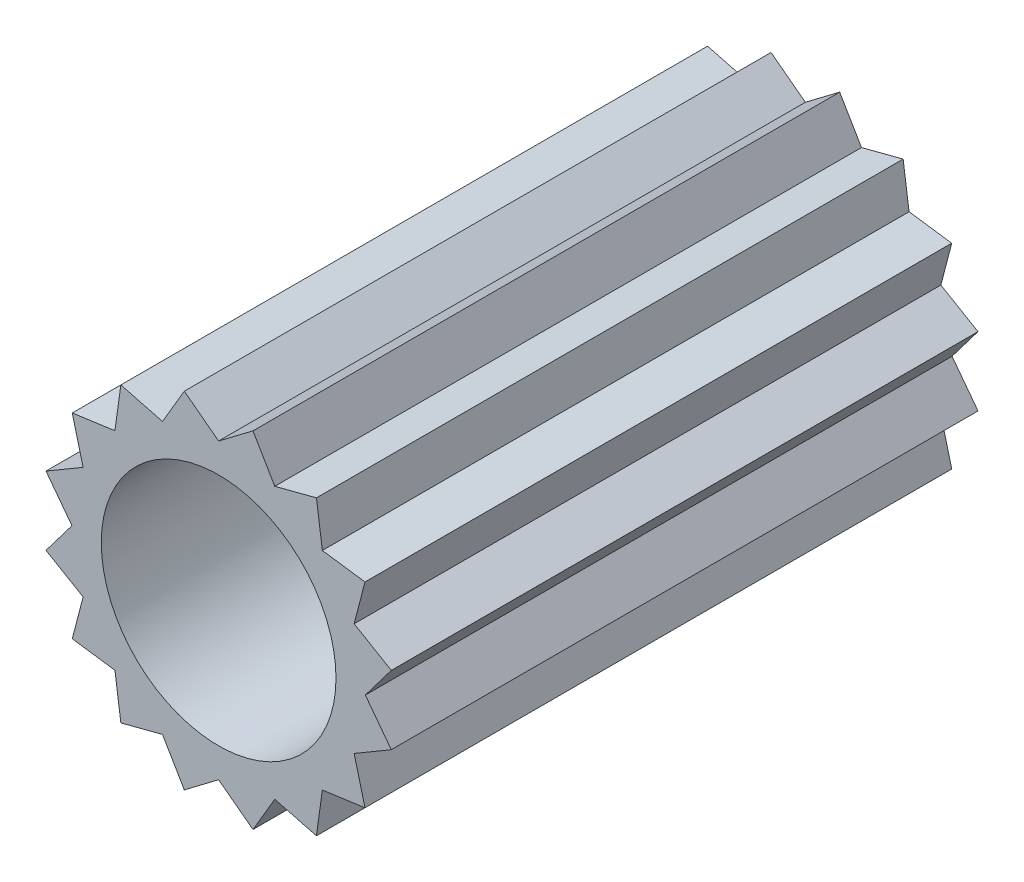
ISO-10303-21;
HEADER;
FILE_DESCRIPTION(('STEP AP214'),'2;1');
FILE_NAME('part.step','',(''),(''),'','','');
FILE_SCHEMA(('AUTOMOTIVE_DESIGN { 1 0 10303 214 1 1 1 1 }'));
ENDSEC;
DATA;
#1=APPLICATION_CONTEXT('core data for automotive mechanical design processes');
#2=APPLICATION_PROTOCOL_DEFINITION('international standard','automotive_design',2000,#1);
#3=PRODUCT_CONTEXT('',#1,'mechanical');
#4=PRODUCT('Part','Part','',(#3));
#5=PRODUCT_RELATED_PRODUCT_CATEGORY('part','',(#4));
#6=PRODUCT_DEFINITION_FORMATION('','',#4);
#7=PRODUCT_DEFINITION_CONTEXT('part definition',#1,'design');
#8=PRODUCT_DEFINITION('design','',#6,#7);
#9=PRODUCT_DEFINITION_SHAPE('','',#8);
#10=(LENGTH_UNIT() NAMED_UNIT(*) SI_UNIT(.MILLI.,.METRE.));
#11=(NAMED_UNIT(*) PLANE_ANGLE_UNIT() SI_UNIT($,.RADIAN.));
#12=(NAMED_UNIT(*) SI_UNIT($,.STERADIAN.) SOLID_ANGLE_UNIT());
#13=UNCERTAINTY_MEASURE_WITH_UNIT(LENGTH_MEASURE(1.E-05),#10,'distance_accuracy_value','');
#14=(GEOMETRIC_REPRESENTATION_CONTEXT(3) GLOBAL_UNCERTAINTY_ASSIGNED_CONTEXT((#13)) GLOBAL_UNIT_ASSIGNED_CONTEXT((#10,
#11,#12)) REPRESENTATION_CONTEXT('',''));
#15=CARTESIAN_POINT('',(0.,0.,0.));
#16=DIRECTION('',(0.,0.,1.));
#17=DIRECTION('',(1.,0.,0.));
#18=AXIS2_PLACEMENT_3D('',#15,#16,#17);
#19=CARTESIAN_POINT('',(0.,0.,10.));
#20=DIRECTION('',(0.,0.,-1.));
#21=DIRECTION('',(-1.,0.,0.));
#22=AXIS2_PLACEMENT_3D('',#19,#20,#21);
#23=PLANE('',#22);
#24=DIRECTION('',(-0.797768242617917,0.602964203805102,0.));
#25=VECTOR('',#24,1.);
#26=CARTESIAN_POINT('',(-0.58527096604841,2.94235584120969,10.));
#27=LINE('',#26,#25);
#28=CARTESIAN_POINT('',(0.,2.5,10.));
#29=VERTEX_POINT('',#28);
#30=CARTESIAN_POINT('',(-0.58527096604841,2.94235584120969,10.));
#31=VERTEX_POINT('',#30);
#32=EDGE_CURVE('E380',#29,#31,#27,.T.);
#33=ORIENTED_EDGE('',*,*,#32,.T.);
#34=DIRECTION('',(-0.506297339936732,-0.862358976049411,0.));
#35=VECTOR('',#34,1.);
#36=CARTESIAN_POINT('',(-0.956708580912729,2.30969883127822,10.));
#37=LINE('',#36,#35);
#38=CARTESIAN_POINT('',(-0.956708580912729,2.30969883127822,10.));
#39=VERTEX_POINT('',#38);
#40=EDGE_CURVE('E172',#31,#39,#37,.T.);
#41=ORIENTED_EDGE('',*,*,#40,.T.);
#42=DIRECTION('',(-0.967786162147611,0.25177359741561,0.));
#43=VECTOR('',#42,1.);
#44=CARTESIAN_POINT('',(-1.66671069905883,2.49440883690762,10.));
#45=LINE('',#44,#43);
#46=CARTESIAN_POINT('',(-1.66671069905883,2.49440883690762,10.));
#47=VERTEX_POINT('',#46);
#48=EDGE_CURVE('E497',#39,#47,#45,.T.);
#49=ORIENTED_EDGE('',*,*,#48,.T.);
#50=DIRECTION('',(-0.137747256847024,-0.990467411493745,0.));
#51=VECTOR('',#50,1.);
#52=CARTESIAN_POINT('',(-1.76776695296638,1.76776695296637,10.));
#53=LINE('',#52,#51);
#54=CARTESIAN_POINT('',(-1.76776695296638,1.76776695296637,10.));
#55=VERTEX_POINT('',#54);
#56=EDGE_CURVE('E517',#47,#55,#53,.T.);
#57=ORIENTED_EDGE('',*,*,#56,.T.);
#58=DIRECTION('',(-0.990467411493739,-0.137747256847065,0.));
#59=VECTOR('',#58,1.);
#60=CARTESIAN_POINT('',(-2.49440883690765,1.66671069905879,10.));
#61=LINE('',#60,#59);
#62=CARTESIAN_POINT('',(-2.49440883690765,1.66671069905879,10.));
#63=VERTEX_POINT('',#62);
#64=EDGE_CURVE('E513',#55,#63,#61,.T.);
#65=ORIENTED_EDGE('',*,*,#64,.T.);
#66=DIRECTION('',(0.25177359741565,-0.967786162147601,0.));
#67=VECTOR('',#66,1.);
#68=CARTESIAN_POINT('',(-2.30969883127823,0.956708580912722,10.));
#69=LINE('',#68,#67);
#70=CARTESIAN_POINT('',(-2.30969883127823,0.956708580912722,10.));
#71=VERTEX_POINT('',#70);
#72=EDGE_CURVE('E516',#63,#71,#69,.T.);
#73=ORIENTED_EDGE('',*,*,#72,.T.);
#74=DIRECTION('',(-0.862358976049388,-0.506297339936772,0.));
#75=VECTOR('',#74,1.);
#76=CARTESIAN_POINT('',(-2.9423558412097,0.585270966048359,10.));
#77=LINE('',#76,#75);
#78=CARTESIAN_POINT('',(-2.9423558412097,0.585270966048359,10.));
#79=VERTEX_POINT('',#78);
#80=EDGE_CURVE('E521',#71,#79,#77,.T.);
#81=ORIENTED_EDGE('',*,*,#80,.T.);
#82=DIRECTION('',(0.602964203805136,-0.797768242617891,0.));
#83=VECTOR('',#82,1.);
#84=CARTESIAN_POINT('',(-2.50000000000001,0.,10.));
#85=LINE('',#84,#83);
#86=CARTESIAN_POINT('',(-2.50000000000001,0.,10.));
#87=VERTEX_POINT('',#86);
#88=EDGE_CURVE('E528',#79,#87,#85,.T.);
#89=ORIENTED_EDGE('',*,*,#88,.T.);
#90=DIRECTION('',(-0.602964203805102,-0.797768242617917,0.));
#91=VECTOR('',#90,1.);
#92=CARTESIAN_POINT('',(-2.94235584120969,-0.585270966048414,10.));
#93=LINE('',#92,#91);
#94=CARTESIAN_POINT('',(-2.94235584120969,-0.585270966048414,10.));
#95=VERTEX_POINT('',#94);
#96=EDGE_CURVE('E531',#87,#95,#93,.T.);
#97=ORIENTED_EDGE('',*,*,#96,.T.);
#98=DIRECTION('',(0.86235897604941,-0.506297339936735,0.));
#99=VECTOR('',#98,1.);
#100=CARTESIAN_POINT('',(-2.30969883127823,-0.956708580912735,10.));
#101=LINE('',#100,#99);
#102=CARTESIAN_POINT('',(-2.30969883127823,-0.956708580912735,10.));
#103=VERTEX_POINT('',#102);
#104=EDGE_CURVE('E534',#95,#103,#101,.T.);
#105=ORIENTED_EDGE('',*,*,#104,.T.);
#106=DIRECTION('',(-0.251773597415609,-0.967786162147611,0.));
#107=VECTOR('',#106,1.);
#108=CARTESIAN_POINT('',(-2.49440883690763,-1.66671069905883,10.));
#109=LINE('',#108,#107);
#110=CARTESIAN_POINT('',(-2.49440883690763,-1.66671069905883,10.));
#111=VERTEX_POINT('',#110);
#112=EDGE_CURVE('E537',#103,#111,#109,.T.);
#113=ORIENTED_EDGE('',*,*,#112,.T.);
#114=DIRECTION('',(0.990467411493745,-0.137747256847027,0.));
#115=VECTOR('',#114,1.);
#116=CARTESIAN_POINT('',(-1.76776695296638,-1.76776695296638,10.));
#117=LINE('',#116,#115);
#118=CARTESIAN_POINT('',(-1.76776695296638,-1.76776695296638,10.));
#119=VERTEX_POINT('',#118);
#120=EDGE_CURVE('E540',#111,#119,#117,.T.);
#121=ORIENTED_EDGE('',*,*,#120,.T.);
#122=DIRECTION('',(0.13774725684707,-0.990467411493739,0.));
#123=VECTOR('',#122,1.);
#124=CARTESIAN_POINT('',(-1.66671069905879,-2.49440883690766,10.));
#125=LINE('',#124,#123);
#126=CARTESIAN_POINT('',(-1.66671069905879,-2.49440883690766,10.));
#127=VERTEX_POINT('',#126);
#128=EDGE_CURVE('E543',#119,#127,#125,.T.);
#129=ORIENTED_EDGE('',*,*,#128,.T.);
#130=DIRECTION('',(0.967786162147601,0.251773597415649,0.));
#131=VECTOR('',#130,1.);
#132=CARTESIAN_POINT('',(-0.956708580912731,-2.30969883127823,10.));
#133=LINE('',#132,#131);
#134=CARTESIAN_POINT('',(-0.956708580912731,-2.30969883127823,10.));
#135=VERTEX_POINT('',#134);
#136=EDGE_CURVE('E546',#127,#135,#133,.T.);
#137=ORIENTED_EDGE('',*,*,#136,.T.);
#138=DIRECTION('',(0.506297339936774,-0.862358976049387,0.));
#139=VECTOR('',#138,1.);
#140=CARTESIAN_POINT('',(-0.585270966048367,-2.94235584120971,10.));
#141=LINE('',#140,#139);
#142=CARTESIAN_POINT('',(-0.585270966048367,-2.94235584120971,10.));
#143=VERTEX_POINT('',#142);
#144=EDGE_CURVE('E549',#135,#143,#141,.T.);
#145=ORIENTED_EDGE('',*,*,#144,.T.);
#146=DIRECTION('',(0.797768242617891,0.602964203805136,0.));
#147=VECTOR('',#146,1.);
#148=CARTESIAN_POINT('',(0.,-2.50000000000002,10.));
#149=LINE('',#148,#147);
#150=CARTESIAN_POINT('',(0.,-2.50000000000002,10.));
#151=VERTEX_POINT('',#150);
#152=EDGE_CURVE('E552',#143,#151,#149,.T.);
#153=ORIENTED_EDGE('',*,*,#152,.T.);
#154=DIRECTION('',(0.797768242617918,-0.602964203805101,0.));
#155=VECTOR('',#154,1.);
#156=CARTESIAN_POINT('',(0.585270966048405,-2.9423558412097,10.));
#157=LINE('',#156,#155);
#158=CARTESIAN_POINT('',(0.585270966048405,-2.9423558412097,10.));
#159=VERTEX_POINT('',#158);
#160=EDGE_CURVE('E555',#151,#159,#157,.T.);
#161=ORIENTED_EDGE('',*,*,#160,.T.);
#162=DIRECTION('',(0.506297339936734,0.86235897604941,0.));
#163=VECTOR('',#162,1.);
#164=CARTESIAN_POINT('',(0.956708580912724,-2.30969883127823,10.));
#165=LINE('',#164,#163);
#166=CARTESIAN_POINT('',(0.956708580912724,-2.30969883127823,10.));
#167=VERTEX_POINT('',#166);
#168=EDGE_CURVE('E558',#159,#167,#165,.T.);
#169=ORIENTED_EDGE('',*,*,#168,.T.);
#170=DIRECTION('',(0.967786162147612,-0.251773597415605,0.));
#171=VECTOR('',#170,1.);
#172=CARTESIAN_POINT('',(1.66671069905883,-2.49440883690764,10.));
#173=LINE('',#172,#171);
#174=CARTESIAN_POINT('',(1.66671069905883,-2.49440883690764,10.));
#175=VERTEX_POINT('',#174);
#176=EDGE_CURVE('E561',#167,#175,#173,.T.);
#177=ORIENTED_EDGE('',*,*,#176,.T.);
#178=DIRECTION('',(0.137747256847025,0.990467411493745,0.));
#179=VECTOR('',#178,1.);
#180=CARTESIAN_POINT('',(1.76776695296637,-1.76776695296638,10.));
#181=LINE('',#180,#179);
#182=CARTESIAN_POINT('',(1.76776695296637,-1.76776695296638,10.));
#183=VERTEX_POINT('',#182);
#184=EDGE_CURVE('E564',#175,#183,#181,.T.);
#185=ORIENTED_EDGE('',*,*,#184,.T.);
#186=DIRECTION('',(0.990467411493739,0.137747256847071,0.));
#187=VECTOR('',#186,1.);
#188=CARTESIAN_POINT('',(2.49440883690765,-1.6667106990588,10.));
#189=LINE('',#188,#187);
#190=CARTESIAN_POINT('',(2.49440883690765,-1.6667106990588,10.));
#191=VERTEX_POINT('',#190);
#192=EDGE_CURVE('E567',#183,#191,#189,.T.);
#193=ORIENTED_EDGE('',*,*,#192,.T.);
#194=DIRECTION('',(-0.251773597415651,0.9677861621476,0.));
#195=VECTOR('',#194,1.);
#196=CARTESIAN_POINT('',(2.30969883127822,-0.956708580912737,10.));
#197=LINE('',#196,#195);
#198=CARTESIAN_POINT('',(2.30969883127822,-0.956708580912737,10.));
#199=VERTEX_POINT('',#198);
#200=EDGE_CURVE('E570',#191,#199,#197,.T.);
#201=ORIENTED_EDGE('',*,*,#200,.T.);
#202=DIRECTION('',(0.862358976049387,0.506297339936774,0.));
#203=VECTOR('',#202,1.);
#204=CARTESIAN_POINT('',(2.9423558412097,-0.585270966048372,10.));
#205=LINE('',#204,#203);
#206=CARTESIAN_POINT('',(2.9423558412097,-0.585270966048372,10.));
#207=VERTEX_POINT('',#206);
#208=EDGE_CURVE('E573',#199,#207,#205,.T.);
#209=ORIENTED_EDGE('',*,*,#208,.T.);
#210=DIRECTION('',(-0.602964203805137,0.79776824261789,0.));
#211=VECTOR('',#210,1.);
#212=CARTESIAN_POINT('',(2.50000000000001,0.,10.));
#213=LINE('',#212,#211);
#214=CARTESIAN_POINT('',(2.50000000000001,0.,10.));
#215=VERTEX_POINT('',#214);
#216=EDGE_CURVE('E576',#207,#215,#213,.T.);
#217=ORIENTED_EDGE('',*,*,#216,.T.);
#218=DIRECTION('',(0.602964203805102,0.797768242617917,0.));
#219=VECTOR('',#218,1.);
#220=CARTESIAN_POINT('',(2.94235584120969,0.5852709660484,10.));
#221=LINE('',#220,#219);
#222=CARTESIAN_POINT('',(2.94235584120969,0.5852709660484,10.));
#223=VERTEX_POINT('',#222);
#224=EDGE_CURVE('E579',#215,#223,#221,.T.);
#225=ORIENTED_EDGE('',*,*,#224,.T.);
#226=DIRECTION('',(-0.862358976049411,0.506297339936732,0.));
#227=VECTOR('',#226,1.);
#228=CARTESIAN_POINT('',(2.30969883127822,0.956708580912718,10.));
#229=LINE('',#228,#227);
#230=CARTESIAN_POINT('',(2.30969883127822,0.956708580912718,10.));
#231=VERTEX_POINT('',#230);
#232=EDGE_CURVE('E582',#223,#231,#229,.T.);
#233=ORIENTED_EDGE('',*,*,#232,.T.);
#234=DIRECTION('',(0.251773597415608,0.967786162147612,0.));
#235=VECTOR('',#234,1.);
#236=CARTESIAN_POINT('',(2.49440883690763,1.66671069905882,10.));
#237=LINE('',#236,#235);
#238=CARTESIAN_POINT('',(2.49440883690763,1.66671069905882,10.));
#239=VERTEX_POINT('',#238);
#240=EDGE_CURVE('E585',#231,#239,#237,.T.);
#241=ORIENTED_EDGE('',*,*,#240,.T.);
#242=DIRECTION('',(-0.990467411493745,0.137747256847023,0.));
#243=VECTOR('',#242,1.);
#244=CARTESIAN_POINT('',(1.76776695296637,1.76776695296637,10.));
#245=LINE('',#244,#243);
#246=CARTESIAN_POINT('',(1.76776695296637,1.76776695296637,10.));
#247=VERTEX_POINT('',#246);
#248=EDGE_CURVE('E588',#239,#247,#245,.T.);
#249=ORIENTED_EDGE('',*,*,#248,.T.);
#250=DIRECTION('',(-0.137747256847068,0.990467411493739,0.));
#251=VECTOR('',#250,1.);
#252=CARTESIAN_POINT('',(1.66671069905879,2.49440883690765,10.));
#253=LINE('',#252,#251);
#254=CARTESIAN_POINT('',(1.66671069905879,2.49440883690765,10.));
#255=VERTEX_POINT('',#254);
#256=EDGE_CURVE('E263',#247,#255,#253,.T.);
#257=ORIENTED_EDGE('',*,*,#256,.T.);
#258=DIRECTION('',(-0.9677861621476,-0.251773597415652,0.));
#259=VECTOR('',#258,1.);
#260=CARTESIAN_POINT('',(0.956708580912726,2.30969883127822,10.));
#261=LINE('',#260,#259);
#262=CARTESIAN_POINT('',(0.956708580912726,2.30969883127822,10.));
#263=VERTEX_POINT('',#262);
#264=EDGE_CURVE('E257',#255,#263,#261,.T.);
#265=ORIENTED_EDGE('',*,*,#264,.T.);
#266=DIRECTION('',(-0.50629733993677,0.862358976049389,0.));
#267=VECTOR('',#266,1.);
#268=CARTESIAN_POINT('',(0.585270966048364,2.94235584120969,10.));
#269=LINE('',#268,#267);
#270=CARTESIAN_POINT('',(0.585270966048364,2.94235584120969,10.));
#271=VERTEX_POINT('',#270);
#272=EDGE_CURVE('E261',#263,#271,#269,.T.);
#273=ORIENTED_EDGE('',*,*,#272,.T.);
#274=DIRECTION('',(-0.797768242617889,-0.602964203805139,0.));
#275=VECTOR('',#274,1.);
#276=CARTESIAN_POINT('',(0.,2.5,10.));
#277=LINE('',#276,#275);
#278=EDGE_CURVE('E57',#271,#29,#277,.T.);
#279=ORIENTED_EDGE('',*,*,#278,.T.);
#280=EDGE_LOOP('',(#33,#41,#49,#57,#65,#73,#81,#89,#97,#105,#113,#121,#129,#137,#145,#153,#161,
#169,#177,#185,#193,#201,#209,#217,#225,#233,#241,#249,#257,#265,#273,#279));
#281=FACE_BOUND('',#280,.T.);
#282=CARTESIAN_POINT('',(0.,0.,10.));
#283=DIRECTION('',(0.,0.,1.));
#284=DIRECTION('',(1.,0.,0.));
#285=AXIS2_PLACEMENT_3D('',#282,#283,#284);
#286=CIRCLE('',#285,2.);
#287=CARTESIAN_POINT('',(2.,0.,10.));
#288=VERTEX_POINT('',#287);
#289=EDGE_CURVE('E290',#288,#288,#286,.T.);
#290=ORIENTED_EDGE('',*,*,#289,.F.);
#291=EDGE_LOOP('',(#290));
#292=FACE_BOUND('',#291,.T.);
#293=ADVANCED_FACE('F39',(#281,#292),#23,.F.);
#294=CARTESIAN_POINT('',(0.,0.,0.));
#295=DIRECTION('',(0.,0.,-1.));
#296=DIRECTION('',(-1.,0.,0.));
#297=AXIS2_PLACEMENT_3D('',#294,#295,#296);
#298=PLANE('',#297);
#299=DIRECTION('',(-0.797768242617917,0.602964203805102,0.));
#300=VECTOR('',#299,1.);
#301=CARTESIAN_POINT('',(-0.58527096604841,2.94235584120969,0.));
#302=LINE('',#301,#300);
#303=CARTESIAN_POINT('',(0.,2.5,0.));
#304=VERTEX_POINT('',#303);
#305=CARTESIAN_POINT('',(-0.58527096604841,2.94235584120969,0.));
#306=VERTEX_POINT('',#305);
#307=EDGE_CURVE('E285',#304,#306,#302,.T.);
#308=ORIENTED_EDGE('',*,*,#307,.F.);
#309=DIRECTION('',(-0.797768242617889,-0.602964203805139,0.));
#310=VECTOR('',#309,1.);
#311=CARTESIAN_POINT('',(0.,2.5,0.));
#312=LINE('',#311,#310);
#313=CARTESIAN_POINT('',(0.585270966048364,2.94235584120969,0.));
#314=VERTEX_POINT('',#313);
#315=EDGE_CURVE('E164',#314,#304,#312,.T.);
#316=ORIENTED_EDGE('',*,*,#315,.F.);
#317=DIRECTION('',(-0.50629733993677,0.862358976049389,0.));
#318=VECTOR('',#317,1.);
#319=CARTESIAN_POINT('',(0.585270966048364,2.94235584120969,0.));
#320=LINE('',#319,#318);
#321=CARTESIAN_POINT('',(0.956708580912726,2.30969883127822,0.));
#322=VERTEX_POINT('',#321);
#323=EDGE_CURVE('E158',#322,#314,#320,.T.);
#324=ORIENTED_EDGE('',*,*,#323,.F.);
#325=DIRECTION('',(-0.9677861621476,-0.251773597415652,0.));
#326=VECTOR('',#325,1.);
#327=CARTESIAN_POINT('',(0.956708580912726,2.30969883127822,0.));
#328=LINE('',#327,#326);
#329=CARTESIAN_POINT('',(1.66671069905879,2.49440883690765,0.));
#330=VERTEX_POINT('',#329);
#331=EDGE_CURVE('E272',#330,#322,#328,.T.);
#332=ORIENTED_EDGE('',*,*,#331,.F.);
#333=DIRECTION('',(-0.137747256847068,0.990467411493739,0.));
#334=VECTOR('',#333,1.);
#335=CARTESIAN_POINT('',(1.66671069905879,2.49440883690765,0.));
#336=LINE('',#335,#334);
#337=CARTESIAN_POINT('',(1.76776695296637,1.76776695296637,0.));
#338=VERTEX_POINT('',#337);
#339=EDGE_CURVE('E371',#338,#330,#336,.T.);
#340=ORIENTED_EDGE('',*,*,#339,.F.);
#341=DIRECTION('',(-0.990467411493745,0.137747256847023,0.));
#342=VECTOR('',#341,1.);
#343=CARTESIAN_POINT('',(1.76776695296637,1.76776695296637,0.));
#344=LINE('',#343,#342);
#345=CARTESIAN_POINT('',(2.49440883690763,1.66671069905882,0.));
#346=VERTEX_POINT('',#345);
#347=EDGE_CURVE('E368',#346,#338,#344,.T.);
#348=ORIENTED_EDGE('',*,*,#347,.F.);
#349=DIRECTION('',(0.251773597415608,0.967786162147612,0.));
#350=VECTOR('',#349,1.);
#351=CARTESIAN_POINT('',(2.49440883690763,1.66671069905882,0.));
#352=LINE('',#351,#350);
#353=CARTESIAN_POINT('',(2.30969883127822,0.956708580912718,0.));
#354=VERTEX_POINT('',#353);
#355=EDGE_CURVE('E365',#354,#346,#352,.T.);
#356=ORIENTED_EDGE('',*,*,#355,.F.);
#357=DIRECTION('',(-0.862358976049411,0.506297339936732,0.));
#358=VECTOR('',#357,1.);
#359=CARTESIAN_POINT('',(2.30969883127822,0.956708580912718,0.));
#360=LINE('',#359,#358);
#361=CARTESIAN_POINT('',(2.94235584120969,0.5852709660484,0.));
#362=VERTEX_POINT('',#361);
#363=EDGE_CURVE('E362',#362,#354,#360,.T.);
#364=ORIENTED_EDGE('',*,*,#363,.F.);
#365=DIRECTION('',(0.602964203805102,0.797768242617917,0.));
#366=VECTOR('',#365,1.);
#367=CARTESIAN_POINT('',(2.94235584120969,0.5852709660484,0.));
#368=LINE('',#367,#366);
#369=CARTESIAN_POINT('',(2.50000000000001,0.,0.));
#370=VERTEX_POINT('',#369);
#371=EDGE_CURVE('E359',#370,#362,#368,.T.);
#372=ORIENTED_EDGE('',*,*,#371,.F.);
#373=DIRECTION('',(-0.602964203805137,0.79776824261789,0.));
#374=VECTOR('',#373,1.);
#375=CARTESIAN_POINT('',(2.50000000000001,0.,0.));
#376=LINE('',#375,#374);
#377=CARTESIAN_POINT('',(2.9423558412097,-0.585270966048372,0.));
#378=VERTEX_POINT('',#377);
#379=EDGE_CURVE('E356',#378,#370,#376,.T.);
#380=ORIENTED_EDGE('',*,*,#379,.F.);
#381=DIRECTION('',(0.862358976049387,0.506297339936774,0.));
#382=VECTOR('',#381,1.);
#383=CARTESIAN_POINT('',(2.9423558412097,-0.585270966048372,0.));
#384=LINE('',#383,#382);
#385=CARTESIAN_POINT('',(2.30969883127822,-0.956708580912737,0.));
#386=VERTEX_POINT('',#385);
#387=EDGE_CURVE('E353',#386,#378,#384,.T.);
#388=ORIENTED_EDGE('',*,*,#387,.F.);
#389=DIRECTION('',(-0.251773597415651,0.9677861621476,0.));
#390=VECTOR('',#389,1.);
#391=CARTESIAN_POINT('',(2.30969883127822,-0.956708580912737,0.));
#392=LINE('',#391,#390);
#393=CARTESIAN_POINT('',(2.49440883690765,-1.6667106990588,0.));
#394=VERTEX_POINT('',#393);
#395=EDGE_CURVE('E350',#394,#386,#392,.T.);
#396=ORIENTED_EDGE('',*,*,#395,.F.);
#397=DIRECTION('',(0.990467411493739,0.137747256847071,0.));
#398=VECTOR('',#397,1.);
#399=CARTESIAN_POINT('',(2.49440883690765,-1.6667106990588,0.));
#400=LINE('',#399,#398);
#401=CARTESIAN_POINT('',(1.76776695296637,-1.76776695296638,0.));
#402=VERTEX_POINT('',#401);
#403=EDGE_CURVE('E347',#402,#394,#400,.T.);
#404=ORIENTED_EDGE('',*,*,#403,.F.);
#405=DIRECTION('',(0.137747256847025,0.990467411493745,0.));
#406=VECTOR('',#405,1.);
#407=CARTESIAN_POINT('',(1.76776695296637,-1.76776695296638,0.));
#408=LINE('',#407,#406);
#409=CARTESIAN_POINT('',(1.66671069905883,-2.49440883690764,0.));
#410=VERTEX_POINT('',#409);
#411=EDGE_CURVE('E344',#410,#402,#408,.T.);
#412=ORIENTED_EDGE('',*,*,#411,.F.);
#413=DIRECTION('',(0.967786162147612,-0.251773597415605,0.));
#414=VECTOR('',#413,1.);
#415=CARTESIAN_POINT('',(1.66671069905883,-2.49440883690764,0.));
#416=LINE('',#415,#414);
#417=CARTESIAN_POINT('',(0.956708580912724,-2.30969883127823,0.));
#418=VERTEX_POINT('',#417);
#419=EDGE_CURVE('E341',#418,#410,#416,.T.);
#420=ORIENTED_EDGE('',*,*,#419,.F.);
#421=DIRECTION('',(0.506297339936734,0.86235897604941,0.));
#422=VECTOR('',#421,1.);
#423=CARTESIAN_POINT('',(0.956708580912724,-2.30969883127823,0.));
#424=LINE('',#423,#422);
#425=CARTESIAN_POINT('',(0.585270966048405,-2.9423558412097,0.));
#426=VERTEX_POINT('',#425);
#427=EDGE_CURVE('E338',#426,#418,#424,.T.);
#428=ORIENTED_EDGE('',*,*,#427,.F.);
#429=DIRECTION('',(0.797768242617918,-0.602964203805101,0.));
#430=VECTOR('',#429,1.);
#431=CARTESIAN_POINT('',(0.585270966048405,-2.9423558412097,0.));
#432=LINE('',#431,#430);
#433=CARTESIAN_POINT('',(0.,-2.50000000000002,0.));
#434=VERTEX_POINT('',#433);
#435=EDGE_CURVE('E335',#434,#426,#432,.T.);
#436=ORIENTED_EDGE('',*,*,#435,.F.);
#437=DIRECTION('',(0.797768242617891,0.602964203805136,0.));
#438=VECTOR('',#437,1.);
#439=CARTESIAN_POINT('',(0.,-2.50000000000002,0.));
#440=LINE('',#439,#438);
#441=CARTESIAN_POINT('',(-0.585270966048367,-2.94235584120971,0.));
#442=VERTEX_POINT('',#441);
#443=EDGE_CURVE('E332',#442,#434,#440,.T.);
#444=ORIENTED_EDGE('',*,*,#443,.F.);
#445=DIRECTION('',(0.506297339936774,-0.862358976049387,0.));
#446=VECTOR('',#445,1.);
#447=CARTESIAN_POINT('',(-0.585270966048367,-2.94235584120971,0.));
#448=LINE('',#447,#446);
#449=CARTESIAN_POINT('',(-0.956708580912731,-2.30969883127823,0.));
#450=VERTEX_POINT('',#449);
#451=EDGE_CURVE('E329',#450,#442,#448,.T.);
#452=ORIENTED_EDGE('',*,*,#451,.F.);
#453=DIRECTION('',(0.967786162147601,0.251773597415649,0.));
#454=VECTOR('',#453,1.);
#455=CARTESIAN_POINT('',(-0.956708580912731,-2.30969883127823,0.));
#456=LINE('',#455,#454);
#457=CARTESIAN_POINT('',(-1.66671069905879,-2.49440883690766,0.));
#458=VERTEX_POINT('',#457);
#459=EDGE_CURVE('E326',#458,#450,#456,.T.);
#460=ORIENTED_EDGE('',*,*,#459,.F.);
#461=DIRECTION('',(0.13774725684707,-0.990467411493739,0.));
#462=VECTOR('',#461,1.);
#463=CARTESIAN_POINT('',(-1.66671069905879,-2.49440883690766,0.));
#464=LINE('',#463,#462);
#465=CARTESIAN_POINT('',(-1.76776695296638,-1.76776695296638,0.));
#466=VERTEX_POINT('',#465);
#467=EDGE_CURVE('E323',#466,#458,#464,.T.);
#468=ORIENTED_EDGE('',*,*,#467,.F.);
#469=DIRECTION('',(0.990467411493745,-0.137747256847027,0.));
#470=VECTOR('',#469,1.);
#471=CARTESIAN_POINT('',(-1.76776695296638,-1.76776695296638,0.));
#472=LINE('',#471,#470);
#473=CARTESIAN_POINT('',(-2.49440883690763,-1.66671069905883,0.));
#474=VERTEX_POINT('',#473);
#475=EDGE_CURVE('E320',#474,#466,#472,.T.);
#476=ORIENTED_EDGE('',*,*,#475,.F.);
#477=DIRECTION('',(-0.251773597415609,-0.967786162147611,0.));
#478=VECTOR('',#477,1.);
#479=CARTESIAN_POINT('',(-2.49440883690763,-1.66671069905883,0.));
#480=LINE('',#479,#478);
#481=CARTESIAN_POINT('',(-2.30969883127823,-0.956708580912735,0.));
#482=VERTEX_POINT('',#481);
#483=EDGE_CURVE('E317',#482,#474,#480,.T.);
#484=ORIENTED_EDGE('',*,*,#483,.F.);
#485=DIRECTION('',(0.86235897604941,-0.506297339936735,0.));
#486=VECTOR('',#485,1.);
#487=CARTESIAN_POINT('',(-2.30969883127823,-0.956708580912735,0.));
#488=LINE('',#487,#486);
#489=CARTESIAN_POINT('',(-2.94235584120969,-0.585270966048414,0.));
#490=VERTEX_POINT('',#489);
#491=EDGE_CURVE('E314',#490,#482,#488,.T.);
#492=ORIENTED_EDGE('',*,*,#491,.F.);
#493=DIRECTION('',(-0.602964203805102,-0.797768242617917,0.));
#494=VECTOR('',#493,1.);
#495=CARTESIAN_POINT('',(-2.94235584120969,-0.585270966048414,0.));
#496=LINE('',#495,#494);
#497=CARTESIAN_POINT('',(-2.50000000000001,0.,0.));
#498=VERTEX_POINT('',#497);
#499=EDGE_CURVE('E311',#498,#490,#496,.T.);
#500=ORIENTED_EDGE('',*,*,#499,.F.);
#501=DIRECTION('',(0.602964203805136,-0.797768242617891,0.));
#502=VECTOR('',#501,1.);
#503=CARTESIAN_POINT('',(-2.50000000000001,0.,0.));
#504=LINE('',#503,#502);
#505=CARTESIAN_POINT('',(-2.9423558412097,0.585270966048359,0.));
#506=VERTEX_POINT('',#505);
#507=EDGE_CURVE('E308',#506,#498,#504,.T.);
#508=ORIENTED_EDGE('',*,*,#507,.F.);
#509=DIRECTION('',(-0.862358976049388,-0.506297339936772,0.));
#510=VECTOR('',#509,1.);
#511=CARTESIAN_POINT('',(-2.9423558412097,0.585270966048359,0.));
#512=LINE('',#511,#510);
#513=CARTESIAN_POINT('',(-2.30969883127823,0.956708580912722,0.));
#514=VERTEX_POINT('',#513);
#515=EDGE_CURVE('E305',#514,#506,#512,.T.);
#516=ORIENTED_EDGE('',*,*,#515,.F.);
#517=DIRECTION('',(0.25177359741565,-0.967786162147601,0.));
#518=VECTOR('',#517,1.);
#519=CARTESIAN_POINT('',(-2.30969883127823,0.956708580912722,0.));
#520=LINE('',#519,#518);
#521=CARTESIAN_POINT('',(-2.49440883690765,1.66671069905879,0.));
#522=VERTEX_POINT('',#521);
#523=EDGE_CURVE('E302',#522,#514,#520,.T.);
#524=ORIENTED_EDGE('',*,*,#523,.F.);
#525=DIRECTION('',(-0.990467411493739,-0.137747256847065,0.));
#526=VECTOR('',#525,1.);
#527=CARTESIAN_POINT('',(-2.49440883690765,1.66671069905879,0.));
#528=LINE('',#527,#526);
#529=CARTESIAN_POINT('',(-1.76776695296638,1.76776695296637,0.));
#530=VERTEX_POINT('',#529);
#531=EDGE_CURVE('E299',#530,#522,#528,.T.);
#532=ORIENTED_EDGE('',*,*,#531,.F.);
#533=DIRECTION('',(-0.137747256847024,-0.990467411493745,0.));
#534=VECTOR('',#533,1.);
#535=CARTESIAN_POINT('',(-1.76776695296638,1.76776695296637,0.));
#536=LINE('',#535,#534);
#537=CARTESIAN_POINT('',(-1.66671069905883,2.49440883690762,0.));
#538=VERTEX_POINT('',#537);
#539=EDGE_CURVE('E296',#538,#530,#536,.T.);
#540=ORIENTED_EDGE('',*,*,#539,.F.);
#541=DIRECTION('',(-0.967786162147611,0.25177359741561,0.));
#542=VECTOR('',#541,1.);
#543=CARTESIAN_POINT('',(-1.66671069905883,2.49440883690762,0.));
#544=LINE('',#543,#542);
#545=CARTESIAN_POINT('',(-0.956708580912729,2.30969883127822,0.));
#546=VERTEX_POINT('',#545);
#547=EDGE_CURVE('E293',#546,#538,#544,.T.);
#548=ORIENTED_EDGE('',*,*,#547,.F.);
#549=DIRECTION('',(-0.506297339936732,-0.862358976049411,0.));
#550=VECTOR('',#549,1.);
#551=CARTESIAN_POINT('',(-0.956708580912729,2.30969883127822,0.));
#552=LINE('',#551,#550);
#553=EDGE_CURVE('E289',#306,#546,#552,.T.);
#554=ORIENTED_EDGE('',*,*,#553,.F.);
#555=EDGE_LOOP('',(#308,#316,#324,#332,#340,#348,#356,#364,#372,#380,#388,#396,#404,#412,#420,
#428,#436,#444,#452,#460,#468,#476,#484,#492,#500,#508,#516,#524,#532,#540,#548,#554));
#556=FACE_BOUND('',#555,.T.);
#557=CARTESIAN_POINT('',(0.,0.,0.));
#558=DIRECTION('',(0.,0.,1.));
#559=DIRECTION('',(1.,0.,0.));
#560=AXIS2_PLACEMENT_3D('',#557,#558,#559);
#561=CIRCLE('',#560,2.);
#562=CARTESIAN_POINT('',(2.,0.,0.));
#563=VERTEX_POINT('',#562);
#564=EDGE_CURVE('E997',#563,#563,#561,.T.);
#565=ORIENTED_EDGE('',*,*,#564,.T.);
#566=EDGE_LOOP('',(#565));
#567=FACE_BOUND('',#566,.T.);
#568=ADVANCED_FACE('F501',(#556,#567),#298,.T.);
#569=CARTESIAN_POINT('',(-0.58527096604841,2.94235584120969,10.));
#570=DIRECTION('',(-0.602964203805102,-0.797768242617917,0.));
#571=DIRECTION('',(0.797768242617917,-0.602964203805102,0.));
#572=AXIS2_PLACEMENT_3D('',#569,#570,#571);
#573=PLANE('',#572);
#574=ORIENTED_EDGE('',*,*,#307,.T.);
#575=DIRECTION('',(0.,0.,-1.));
#576=VECTOR('',#575,1.);
#577=CARTESIAN_POINT('',(-0.58527096604841,2.94235584120969,10.));
#578=LINE('',#577,#576);
#579=EDGE_CURVE('E11',#31,#306,#578,.T.);
#580=ORIENTED_EDGE('',*,*,#579,.F.);
#581=ORIENTED_EDGE('',*,*,#32,.F.);
#582=DIRECTION('',(0.,0.,-1.));
#583=VECTOR('',#582,1.);
#584=CARTESIAN_POINT('',(0.,2.5,10.));
#585=LINE('',#584,#583);
#586=EDGE_CURVE('E281',#29,#304,#585,.T.);
#587=ORIENTED_EDGE('',*,*,#586,.T.);
#588=EDGE_LOOP('',(#574,#580,#581,#587));
#589=FACE_BOUND('',#588,.T.);
#590=ADVANCED_FACE('F41',(#589),#573,.F.);
#591=CARTESIAN_POINT('',(-0.956708580912729,2.30969883127822,10.));
#592=DIRECTION('',(0.862358976049411,-0.506297339936732,0.));
#593=DIRECTION('',(0.506297339936732,0.862358976049411,0.));
#594=AXIS2_PLACEMENT_3D('',#591,#592,#593);
#595=PLANE('',#594);
#596=ORIENTED_EDGE('',*,*,#553,.T.);
#597=DIRECTION('',(0.,0.,-1.));
#598=VECTOR('',#597,1.);
#599=CARTESIAN_POINT('',(-0.956708580912729,2.30969883127822,10.));
#600=LINE('',#599,#598);
#601=EDGE_CURVE('E49',#39,#546,#600,.T.);
#602=ORIENTED_EDGE('',*,*,#601,.F.);
#603=ORIENTED_EDGE('',*,*,#40,.F.);
#604=ORIENTED_EDGE('',*,*,#579,.T.);
#605=EDGE_LOOP('',(#596,#602,#603,#604));
#606=FACE_BOUND('',#605,.T.);
#607=ADVANCED_FACE('F624',(#606),#595,.F.);
#608=CARTESIAN_POINT('',(-1.66671069905883,2.49440883690762,10.));
#609=DIRECTION('',(-0.25177359741561,-0.967786162147611,0.));
#610=DIRECTION('',(0.967786162147611,-0.25177359741561,0.));
#611=AXIS2_PLACEMENT_3D('',#608,#609,#610);
#612=PLANE('',#611);
#613=ORIENTED_EDGE('',*,*,#547,.T.);
#614=DIRECTION('',(0.,0.,-1.));
#615=VECTOR('',#614,1.);
#616=CARTESIAN_POINT('',(-1.66671069905883,2.49440883690762,10.));
#617=LINE('',#616,#615);
#618=EDGE_CURVE('E487',#47,#538,#617,.T.);
#619=ORIENTED_EDGE('',*,*,#618,.F.);
#620=ORIENTED_EDGE('',*,*,#48,.F.);
#621=ORIENTED_EDGE('',*,*,#601,.T.);
#622=EDGE_LOOP('',(#613,#619,#620,#621));
#623=FACE_BOUND('',#622,.T.);
#624=ADVANCED_FACE('F495',(#623),#612,.F.);
#625=CARTESIAN_POINT('',(-1.76776695296638,1.76776695296637,10.));
#626=DIRECTION('',(0.990467411493745,-0.137747256847024,0.));
#627=DIRECTION('',(0.137747256847024,0.990467411493745,0.));
#628=AXIS2_PLACEMENT_3D('',#625,#626,#627);
#629=PLANE('',#628);
#630=ORIENTED_EDGE('',*,*,#539,.T.);
#631=DIRECTION('',(0.,0.,-1.));
#632=VECTOR('',#631,1.);
#633=CARTESIAN_POINT('',(-1.76776695296638,1.76776695296637,10.));
#634=LINE('',#633,#632);
#635=EDGE_CURVE('E483',#55,#530,#634,.T.);
#636=ORIENTED_EDGE('',*,*,#635,.F.);
#637=ORIENTED_EDGE('',*,*,#56,.F.);
#638=ORIENTED_EDGE('',*,*,#618,.T.);
#639=EDGE_LOOP('',(#630,#636,#637,#638));
#640=FACE_BOUND('',#639,.T.);
#641=ADVANCED_FACE('F507',(#640),#629,.F.);
#642=CARTESIAN_POINT('',(-2.49440883690765,1.66671069905879,10.));
#643=DIRECTION('',(0.137747256847065,-0.99046741149374,0.));
#644=DIRECTION('',(0.99046741149374,0.137747256847065,0.));
#645=AXIS2_PLACEMENT_3D('',#642,#643,#644);
#646=PLANE('',#645);
#647=ORIENTED_EDGE('',*,*,#531,.T.);
#648=DIRECTION('',(0.,0.,-1.));
#649=VECTOR('',#648,1.);
#650=CARTESIAN_POINT('',(-2.49440883690765,1.66671069905879,10.));
#651=LINE('',#650,#649);
#652=EDGE_CURVE('E479',#63,#522,#651,.T.);
#653=ORIENTED_EDGE('',*,*,#652,.F.);
#654=ORIENTED_EDGE('',*,*,#64,.F.);
#655=ORIENTED_EDGE('',*,*,#635,.T.);
#656=EDGE_LOOP('',(#647,#653,#654,#655));
#657=FACE_BOUND('',#656,.T.);
#658=ADVANCED_FACE('F511',(#657),#646,.F.);
#659=CARTESIAN_POINT('',(-2.30969883127823,0.956708580912722,10.));
#660=DIRECTION('',(0.967786162147601,0.25177359741565,0.));
#661=DIRECTION('',(-0.25177359741565,0.967786162147601,0.));
#662=AXIS2_PLACEMENT_3D('',#659,#660,#661);
#663=PLANE('',#662);
#664=ORIENTED_EDGE('',*,*,#523,.T.);
#665=DIRECTION('',(0.,0.,-1.));
#666=VECTOR('',#665,1.);
#667=CARTESIAN_POINT('',(-2.30969883127823,0.956708580912722,10.));
#668=LINE('',#667,#666);
#669=EDGE_CURVE('E475',#71,#514,#668,.T.);
#670=ORIENTED_EDGE('',*,*,#669,.F.);
#671=ORIENTED_EDGE('',*,*,#72,.F.);
#672=ORIENTED_EDGE('',*,*,#652,.T.);
#673=EDGE_LOOP('',(#664,#670,#671,#672));
#674=FACE_BOUND('',#673,.T.);
#675=ADVANCED_FACE('F637',(#674),#663,.F.);
#676=CARTESIAN_POINT('',(-2.9423558412097,0.585270966048359,10.));
#677=DIRECTION('',(0.506297339936772,-0.862358976049388,0.));
#678=DIRECTION('',(0.862358976049388,0.506297339936772,0.));
#679=AXIS2_PLACEMENT_3D('',#676,#677,#678);
#680=PLANE('',#679);
#681=ORIENTED_EDGE('',*,*,#515,.T.);
#682=DIRECTION('',(0.,0.,-1.));
#683=VECTOR('',#682,1.);
#684=CARTESIAN_POINT('',(-2.9423558412097,0.585270966048359,10.));
#685=LINE('',#684,#683);
#686=EDGE_CURVE('E471',#79,#506,#685,.T.);
#687=ORIENTED_EDGE('',*,*,#686,.F.);
#688=ORIENTED_EDGE('',*,*,#80,.F.);
#689=ORIENTED_EDGE('',*,*,#669,.T.);
#690=EDGE_LOOP('',(#681,#687,#688,#689));
#691=FACE_BOUND('',#690,.T.);
#692=ADVANCED_FACE('F640',(#691),#680,.F.);
#693=CARTESIAN_POINT('',(-2.50000000000001,0.,10.));
#694=DIRECTION('',(0.797768242617891,0.602964203805136,0.));
#695=DIRECTION('',(-0.602964203805136,0.797768242617891,0.));
#696=AXIS2_PLACEMENT_3D('',#693,#694,#695);
#697=PLANE('',#696);
#698=ORIENTED_EDGE('',*,*,#507,.T.);
#699=DIRECTION('',(0.,0.,-1.));
#700=VECTOR('',#699,1.);
#701=CARTESIAN_POINT('',(-2.50000000000001,0.,10.));
#702=LINE('',#701,#700);
#703=EDGE_CURVE('E467',#87,#498,#702,.T.);
#704=ORIENTED_EDGE('',*,*,#703,.F.);
#705=ORIENTED_EDGE('',*,*,#88,.F.);
#706=ORIENTED_EDGE('',*,*,#686,.T.);
#707=EDGE_LOOP('',(#698,#704,#705,#706));
#708=FACE_BOUND('',#707,.T.);
#709=ADVANCED_FACE('F644',(#708),#697,.F.);
#710=CARTESIAN_POINT('',(-2.94235584120969,-0.585270966048414,10.));
#711=DIRECTION('',(0.797768242617917,-0.602964203805102,0.));
#712=DIRECTION('',(0.602964203805102,0.797768242617917,0.));
#713=AXIS2_PLACEMENT_3D('',#710,#711,#712);
#714=PLANE('',#713);
#715=ORIENTED_EDGE('',*,*,#499,.T.);
#716=DIRECTION('',(0.,0.,-1.));
#717=VECTOR('',#716,1.);
#718=CARTESIAN_POINT('',(-2.94235584120969,-0.585270966048414,10.));
#719=LINE('',#718,#717);
#720=EDGE_CURVE('E463',#95,#490,#719,.T.);
#721=ORIENTED_EDGE('',*,*,#720,.F.);
#722=ORIENTED_EDGE('',*,*,#96,.F.);
#723=ORIENTED_EDGE('',*,*,#703,.T.);
#724=EDGE_LOOP('',(#715,#721,#722,#723));
#725=FACE_BOUND('',#724,.T.);
#726=ADVANCED_FACE('F648',(#725),#714,.F.);
#727=CARTESIAN_POINT('',(-2.30969883127823,-0.956708580912735,10.));
#728=DIRECTION('',(0.506297339936735,0.86235897604941,0.));
#729=DIRECTION('',(-0.86235897604941,0.506297339936735,0.));
#730=AXIS2_PLACEMENT_3D('',#727,#728,#729);
#731=PLANE('',#730);
#732=ORIENTED_EDGE('',*,*,#491,.T.);
#733=DIRECTION('',(0.,0.,-1.));
#734=VECTOR('',#733,1.);
#735=CARTESIAN_POINT('',(-2.30969883127823,-0.956708580912735,10.));
#736=LINE('',#735,#734);
#737=EDGE_CURVE('E459',#103,#482,#736,.T.);
#738=ORIENTED_EDGE('',*,*,#737,.F.);
#739=ORIENTED_EDGE('',*,*,#104,.F.);
#740=ORIENTED_EDGE('',*,*,#720,.T.);
#741=EDGE_LOOP('',(#732,#738,#739,#740));
#742=FACE_BOUND('',#741,.T.);
#743=ADVANCED_FACE('F652',(#742),#731,.F.);
#744=CARTESIAN_POINT('',(-2.49440883690763,-1.66671069905883,10.));
#745=DIRECTION('',(0.967786162147611,-0.251773597415609,0.));
#746=DIRECTION('',(0.251773597415609,0.967786162147611,0.));
#747=AXIS2_PLACEMENT_3D('',#744,#745,#746);
#748=PLANE('',#747);
#749=ORIENTED_EDGE('',*,*,#483,.T.);
#750=DIRECTION('',(0.,0.,-1.));
#751=VECTOR('',#750,1.);
#752=CARTESIAN_POINT('',(-2.49440883690763,-1.66671069905883,10.));
#753=LINE('',#752,#751);
#754=EDGE_CURVE('E455',#111,#474,#753,.T.);
#755=ORIENTED_EDGE('',*,*,#754,.F.);
#756=ORIENTED_EDGE('',*,*,#112,.F.);
#757=ORIENTED_EDGE('',*,*,#737,.T.);
#758=EDGE_LOOP('',(#749,#755,#756,#757));
#759=FACE_BOUND('',#758,.T.);
#760=ADVANCED_FACE('F656',(#759),#748,.F.);
#761=CARTESIAN_POINT('',(-1.76776695296638,-1.76776695296638,10.));
#762=DIRECTION('',(0.137747256847027,0.990467411493745,0.));
#763=DIRECTION('',(-0.990467411493745,0.137747256847027,0.));
#764=AXIS2_PLACEMENT_3D('',#761,#762,#763);
#765=PLANE('',#764);
#766=ORIENTED_EDGE('',*,*,#475,.T.);
#767=DIRECTION('',(0.,0.,-1.));
#768=VECTOR('',#767,1.);
#769=CARTESIAN_POINT('',(-1.76776695296638,-1.76776695296638,10.));
#770=LINE('',#769,#768);
#771=EDGE_CURVE('E451',#119,#466,#770,.T.);
#772=ORIENTED_EDGE('',*,*,#771,.F.);
#773=ORIENTED_EDGE('',*,*,#120,.F.);
#774=ORIENTED_EDGE('',*,*,#754,.T.);
#775=EDGE_LOOP('',(#766,#772,#773,#774));
#776=FACE_BOUND('',#775,.T.);
#777=ADVANCED_FACE('F660',(#776),#765,.F.);
#778=CARTESIAN_POINT('',(-1.66671069905879,-2.49440883690766,10.));
#779=DIRECTION('',(0.990467411493739,0.13774725684707,0.));
#780=DIRECTION('',(-0.13774725684707,0.990467411493739,0.));
#781=AXIS2_PLACEMENT_3D('',#778,#779,#780);
#782=PLANE('',#781);
#783=ORIENTED_EDGE('',*,*,#467,.T.);
#784=DIRECTION('',(0.,0.,-1.));
#785=VECTOR('',#784,1.);
#786=CARTESIAN_POINT('',(-1.66671069905879,-2.49440883690766,10.));
#787=LINE('',#786,#785);
#788=EDGE_CURVE('E447',#127,#458,#787,.T.);
#789=ORIENTED_EDGE('',*,*,#788,.F.);
#790=ORIENTED_EDGE('',*,*,#128,.F.);
#791=ORIENTED_EDGE('',*,*,#771,.T.);
#792=EDGE_LOOP('',(#783,#789,#790,#791));
#793=FACE_BOUND('',#792,.T.);
#794=ADVANCED_FACE('F664',(#793),#782,.F.);
#795=CARTESIAN_POINT('',(-0.956708580912731,-2.30969883127823,10.));
#796=DIRECTION('',(-0.251773597415649,0.967786162147601,0.));
#797=DIRECTION('',(-0.967786162147601,-0.251773597415649,0.));
#798=AXIS2_PLACEMENT_3D('',#795,#796,#797);
#799=PLANE('',#798);
#800=ORIENTED_EDGE('',*,*,#459,.T.);
#801=DIRECTION('',(0.,0.,-1.));
#802=VECTOR('',#801,1.);
#803=CARTESIAN_POINT('',(-0.956708580912731,-2.30969883127823,10.));
#804=LINE('',#803,#802);
#805=EDGE_CURVE('E443',#135,#450,#804,.T.);
#806=ORIENTED_EDGE('',*,*,#805,.F.);
#807=ORIENTED_EDGE('',*,*,#136,.F.);
#808=ORIENTED_EDGE('',*,*,#788,.T.);
#809=EDGE_LOOP('',(#800,#806,#807,#808));
#810=FACE_BOUND('',#809,.T.);
#811=ADVANCED_FACE('F668',(#810),#799,.F.);
#812=CARTESIAN_POINT('',(-0.585270966048367,-2.94235584120971,10.));
#813=DIRECTION('',(0.862358976049387,0.506297339936774,0.));
#814=DIRECTION('',(-0.506297339936774,0.862358976049387,0.));
#815=AXIS2_PLACEMENT_3D('',#812,#813,#814);
#816=PLANE('',#815);
#817=ORIENTED_EDGE('',*,*,#451,.T.);
#818=DIRECTION('',(0.,0.,-1.));
#819=VECTOR('',#818,1.);
#820=CARTESIAN_POINT('',(-0.585270966048367,-2.94235584120971,10.));
#821=LINE('',#820,#819);
#822=EDGE_CURVE('E439',#143,#442,#821,.T.);
#823=ORIENTED_EDGE('',*,*,#822,.F.);
#824=ORIENTED_EDGE('',*,*,#144,.F.);
#825=ORIENTED_EDGE('',*,*,#805,.T.);
#826=EDGE_LOOP('',(#817,#823,#824,#825));
#827=FACE_BOUND('',#826,.T.);
#828=ADVANCED_FACE('F672',(#827),#816,.F.);
#829=CARTESIAN_POINT('',(0.,-2.50000000000002,10.));
#830=DIRECTION('',(-0.602964203805136,0.797768242617891,0.));
#831=DIRECTION('',(-0.797768242617891,-0.602964203805136,0.));
#832=AXIS2_PLACEMENT_3D('',#829,#830,#831);
#833=PLANE('',#832);
#834=ORIENTED_EDGE('',*,*,#443,.T.);
#835=DIRECTION('',(0.,0.,-1.));
#836=VECTOR('',#835,1.);
#837=CARTESIAN_POINT('',(0.,-2.50000000000002,10.));
#838=LINE('',#837,#836);
#839=EDGE_CURVE('E435',#151,#434,#838,.T.);
#840=ORIENTED_EDGE('',*,*,#839,.F.);
#841=ORIENTED_EDGE('',*,*,#152,.F.);
#842=ORIENTED_EDGE('',*,*,#822,.T.);
#843=EDGE_LOOP('',(#834,#840,#841,#842));
#844=FACE_BOUND('',#843,.T.);
#845=ADVANCED_FACE('F676',(#844),#833,.F.);
#846=CARTESIAN_POINT('',(0.585270966048405,-2.9423558412097,10.));
#847=DIRECTION('',(0.602964203805101,0.797768242617918,0.));
#848=DIRECTION('',(-0.797768242617918,0.602964203805101,0.));
#849=AXIS2_PLACEMENT_3D('',#846,#847,#848);
#850=PLANE('',#849);
#851=ORIENTED_EDGE('',*,*,#435,.T.);
#852=DIRECTION('',(0.,0.,-1.));
#853=VECTOR('',#852,1.);
#854=CARTESIAN_POINT('',(0.585270966048405,-2.9423558412097,10.));
#855=LINE('',#854,#853);
#856=EDGE_CURVE('E431',#159,#426,#855,.T.);
#857=ORIENTED_EDGE('',*,*,#856,.F.);
#858=ORIENTED_EDGE('',*,*,#160,.F.);
#859=ORIENTED_EDGE('',*,*,#839,.T.);
#860=EDGE_LOOP('',(#851,#857,#858,#859));
#861=FACE_BOUND('',#860,.T.);
#862=ADVANCED_FACE('F680',(#861),#850,.F.);
#863=CARTESIAN_POINT('',(0.956708580912724,-2.30969883127823,10.));
#864=DIRECTION('',(-0.86235897604941,0.506297339936734,0.));
#865=DIRECTION('',(-0.506297339936734,-0.86235897604941,0.));
#866=AXIS2_PLACEMENT_3D('',#863,#864,#865);
#867=PLANE('',#866);
#868=ORIENTED_EDGE('',*,*,#427,.T.);
#869=DIRECTION('',(0.,0.,-1.));
#870=VECTOR('',#869,1.);
#871=CARTESIAN_POINT('',(0.956708580912724,-2.30969883127823,10.));
#872=LINE('',#871,#870);
#873=EDGE_CURVE('E427',#167,#418,#872,.T.);
#874=ORIENTED_EDGE('',*,*,#873,.F.);
#875=ORIENTED_EDGE('',*,*,#168,.F.);
#876=ORIENTED_EDGE('',*,*,#856,.T.);
#877=EDGE_LOOP('',(#868,#874,#875,#876));
#878=FACE_BOUND('',#877,.T.);
#879=ADVANCED_FACE('F684',(#878),#867,.F.);
#880=CARTESIAN_POINT('',(1.66671069905883,-2.49440883690764,10.));
#881=DIRECTION('',(0.251773597415605,0.967786162147612,0.));
#882=DIRECTION('',(-0.967786162147612,0.251773597415605,0.));
#883=AXIS2_PLACEMENT_3D('',#880,#881,#882);
#884=PLANE('',#883);
#885=ORIENTED_EDGE('',*,*,#419,.T.);
#886=DIRECTION('',(0.,0.,-1.));
#887=VECTOR('',#886,1.);
#888=CARTESIAN_POINT('',(1.66671069905883,-2.49440883690764,10.));
#889=LINE('',#888,#887);
#890=EDGE_CURVE('E423',#175,#410,#889,.T.);
#891=ORIENTED_EDGE('',*,*,#890,.F.);
#892=ORIENTED_EDGE('',*,*,#176,.F.);
#893=ORIENTED_EDGE('',*,*,#873,.T.);
#894=EDGE_LOOP('',(#885,#891,#892,#893));
#895=FACE_BOUND('',#894,.T.);
#896=ADVANCED_FACE('F688',(#895),#884,.F.);
#897=CARTESIAN_POINT('',(1.76776695296637,-1.76776695296638,10.));
#898=DIRECTION('',(-0.990467411493745,0.137747256847025,0.));
#899=DIRECTION('',(-0.137747256847025,-0.990467411493745,0.));
#900=AXIS2_PLACEMENT_3D('',#897,#898,#899);
#901=PLANE('',#900);
#902=ORIENTED_EDGE('',*,*,#411,.T.);
#903=DIRECTION('',(0.,0.,-1.));
#904=VECTOR('',#903,1.);
#905=CARTESIAN_POINT('',(1.76776695296637,-1.76776695296638,10.));
#906=LINE('',#905,#904);
#907=EDGE_CURVE('E419',#183,#402,#906,.T.);
#908=ORIENTED_EDGE('',*,*,#907,.F.);
#909=ORIENTED_EDGE('',*,*,#184,.F.);
#910=ORIENTED_EDGE('',*,*,#890,.T.);
#911=EDGE_LOOP('',(#902,#908,#909,#910));
#912=FACE_BOUND('',#911,.T.);
#913=ADVANCED_FACE('F692',(#912),#901,.F.);
#914=CARTESIAN_POINT('',(2.49440883690765,-1.6667106990588,10.));
#915=DIRECTION('',(-0.137747256847071,0.990467411493739,0.));
#916=DIRECTION('',(-0.990467411493739,-0.137747256847071,0.));
#917=AXIS2_PLACEMENT_3D('',#914,#915,#916);
#918=PLANE('',#917);
#919=ORIENTED_EDGE('',*,*,#403,.T.);
#920=DIRECTION('',(0.,0.,-1.));
#921=VECTOR('',#920,1.);
#922=CARTESIAN_POINT('',(2.49440883690765,-1.6667106990588,10.));
#923=LINE('',#922,#921);
#924=EDGE_CURVE('E415',#191,#394,#923,.T.);
#925=ORIENTED_EDGE('',*,*,#924,.F.);
#926=ORIENTED_EDGE('',*,*,#192,.F.);
#927=ORIENTED_EDGE('',*,*,#907,.T.);
#928=EDGE_LOOP('',(#919,#925,#926,#927));
#929=FACE_BOUND('',#928,.T.);
#930=ADVANCED_FACE('F696',(#929),#918,.F.);
#931=CARTESIAN_POINT('',(2.30969883127822,-0.956708580912737,10.));
#932=DIRECTION('',(-0.9677861621476,-0.251773597415651,0.));
#933=DIRECTION('',(0.251773597415651,-0.9677861621476,0.));
#934=AXIS2_PLACEMENT_3D('',#931,#932,#933);
#935=PLANE('',#934);
#936=ORIENTED_EDGE('',*,*,#395,.T.);
#937=DIRECTION('',(0.,0.,-1.));
#938=VECTOR('',#937,1.);
#939=CARTESIAN_POINT('',(2.30969883127822,-0.956708580912737,10.));
#940=LINE('',#939,#938);
#941=EDGE_CURVE('E411',#199,#386,#940,.T.);
#942=ORIENTED_EDGE('',*,*,#941,.F.);
#943=ORIENTED_EDGE('',*,*,#200,.F.);
#944=ORIENTED_EDGE('',*,*,#924,.T.);
#945=EDGE_LOOP('',(#936,#942,#943,#944));
#946=FACE_BOUND('',#945,.T.);
#947=ADVANCED_FACE('F700',(#946),#935,.F.);
#948=CARTESIAN_POINT('',(2.9423558412097,-0.585270966048372,10.));
#949=DIRECTION('',(-0.506297339936774,0.862358976049387,0.));
#950=DIRECTION('',(-0.862358976049387,-0.506297339936774,0.));
#951=AXIS2_PLACEMENT_3D('',#948,#949,#950);
#952=PLANE('',#951);
#953=ORIENTED_EDGE('',*,*,#387,.T.);
#954=DIRECTION('',(0.,0.,-1.));
#955=VECTOR('',#954,1.);
#956=CARTESIAN_POINT('',(2.9423558412097,-0.585270966048372,10.));
#957=LINE('',#956,#955);
#958=EDGE_CURVE('E407',#207,#378,#957,.T.);
#959=ORIENTED_EDGE('',*,*,#958,.F.);
#960=ORIENTED_EDGE('',*,*,#208,.F.);
#961=ORIENTED_EDGE('',*,*,#941,.T.);
#962=EDGE_LOOP('',(#953,#959,#960,#961));
#963=FACE_BOUND('',#962,.T.);
#964=ADVANCED_FACE('F704',(#963),#952,.F.);
#965=CARTESIAN_POINT('',(2.50000000000001,0.,10.));
#966=DIRECTION('',(-0.79776824261789,-0.602964203805137,0.));
#967=DIRECTION('',(0.602964203805137,-0.79776824261789,0.));
#968=AXIS2_PLACEMENT_3D('',#965,#966,#967);
#969=PLANE('',#968);
#970=ORIENTED_EDGE('',*,*,#379,.T.);
#971=DIRECTION('',(0.,0.,-1.));
#972=VECTOR('',#971,1.);
#973=CARTESIAN_POINT('',(2.50000000000001,0.,10.));
#974=LINE('',#973,#972);
#975=EDGE_CURVE('E403',#215,#370,#974,.T.);
#976=ORIENTED_EDGE('',*,*,#975,.F.);
#977=ORIENTED_EDGE('',*,*,#216,.F.);
#978=ORIENTED_EDGE('',*,*,#958,.T.);
#979=EDGE_LOOP('',(#970,#976,#977,#978));
#980=FACE_BOUND('',#979,.T.);
#981=ADVANCED_FACE('F708',(#980),#969,.F.);
#982=CARTESIAN_POINT('',(2.94235584120969,0.5852709660484,10.));
#983=DIRECTION('',(-0.797768242617917,0.602964203805102,0.));
#984=DIRECTION('',(-0.602964203805102,-0.797768242617917,0.));
#985=AXIS2_PLACEMENT_3D('',#982,#983,#984);
#986=PLANE('',#985);
#987=ORIENTED_EDGE('',*,*,#371,.T.);
#988=DIRECTION('',(0.,0.,-1.));
#989=VECTOR('',#988,1.);
#990=CARTESIAN_POINT('',(2.94235584120969,0.5852709660484,10.));
#991=LINE('',#990,#989);
#992=EDGE_CURVE('E399',#223,#362,#991,.T.);
#993=ORIENTED_EDGE('',*,*,#992,.F.);
#994=ORIENTED_EDGE('',*,*,#224,.F.);
#995=ORIENTED_EDGE('',*,*,#975,.T.);
#996=EDGE_LOOP('',(#987,#993,#994,#995));
#997=FACE_BOUND('',#996,.T.);
#998=ADVANCED_FACE('F712',(#997),#986,.F.);
#999=CARTESIAN_POINT('',(2.30969883127822,0.956708580912718,10.));
#1000=DIRECTION('',(-0.506297339936732,-0.862358976049411,0.));
#1001=DIRECTION('',(0.862358976049411,-0.506297339936732,0.));
#1002=AXIS2_PLACEMENT_3D('',#999,#1000,#1001);
#1003=PLANE('',#1002);
#1004=ORIENTED_EDGE('',*,*,#363,.T.);
#1005=DIRECTION('',(0.,0.,-1.));
#1006=VECTOR('',#1005,1.);
#1007=CARTESIAN_POINT('',(2.30969883127822,0.956708580912718,10.));
#1008=LINE('',#1007,#1006);
#1009=EDGE_CURVE('E395',#231,#354,#1008,.T.);
#1010=ORIENTED_EDGE('',*,*,#1009,.F.);
#1011=ORIENTED_EDGE('',*,*,#232,.F.);
#1012=ORIENTED_EDGE('',*,*,#992,.T.);
#1013=EDGE_LOOP('',(#1004,#1010,#1011,#1012));
#1014=FACE_BOUND('',#1013,.T.);
#1015=ADVANCED_FACE('F716',(#1014),#1003,.F.);
#1016=CARTESIAN_POINT('',(2.49440883690763,1.66671069905882,10.));
#1017=DIRECTION('',(-0.967786162147612,0.251773597415608,0.));
#1018=DIRECTION('',(-0.251773597415608,-0.967786162147612,0.));
#1019=AXIS2_PLACEMENT_3D('',#1016,#1017,#1018);
#1020=PLANE('',#1019);
#1021=ORIENTED_EDGE('',*,*,#355,.T.);
#1022=DIRECTION('',(0.,0.,-1.));
#1023=VECTOR('',#1022,1.);
#1024=CARTESIAN_POINT('',(2.49440883690763,1.66671069905882,10.));
#1025=LINE('',#1024,#1023);
#1026=EDGE_CURVE('E391',#239,#346,#1025,.T.);
#1027=ORIENTED_EDGE('',*,*,#1026,.F.);
#1028=ORIENTED_EDGE('',*,*,#240,.F.);
#1029=ORIENTED_EDGE('',*,*,#1009,.T.);
#1030=EDGE_LOOP('',(#1021,#1027,#1028,#1029));
#1031=FACE_BOUND('',#1030,.T.);
#1032=ADVANCED_FACE('F720',(#1031),#1020,.F.);
#1033=CARTESIAN_POINT('',(1.76776695296637,1.76776695296637,10.));
#1034=DIRECTION('',(-0.137747256847023,-0.990467411493745,0.));
#1035=DIRECTION('',(0.990467411493745,-0.137747256847023,0.));
#1036=AXIS2_PLACEMENT_3D('',#1033,#1034,#1035);
#1037=PLANE('',#1036);
#1038=ORIENTED_EDGE('',*,*,#347,.T.);
#1039=DIRECTION('',(0.,0.,-1.));
#1040=VECTOR('',#1039,1.);
#1041=CARTESIAN_POINT('',(1.76776695296637,1.76776695296637,10.));
#1042=LINE('',#1041,#1040);
#1043=EDGE_CURVE('E387',#247,#338,#1042,.T.);
#1044=ORIENTED_EDGE('',*,*,#1043,.F.);
#1045=ORIENTED_EDGE('',*,*,#248,.F.);
#1046=ORIENTED_EDGE('',*,*,#1026,.T.);
#1047=EDGE_LOOP('',(#1038,#1044,#1045,#1046));
#1048=FACE_BOUND('',#1047,.T.);
#1049=ADVANCED_FACE('F596',(#1048),#1037,.F.);
#1050=CARTESIAN_POINT('',(1.66671069905879,2.49440883690765,10.));
#1051=DIRECTION('',(-0.990467411493739,-0.137747256847068,0.));
#1052=DIRECTION('',(0.137747256847068,-0.990467411493739,0.));
#1053=AXIS2_PLACEMENT_3D('',#1050,#1051,#1052);
#1054=PLANE('',#1053);
#1055=ORIENTED_EDGE('',*,*,#339,.T.);
#1056=DIRECTION('',(0.,0.,-1.));
#1057=VECTOR('',#1056,1.);
#1058=CARTESIAN_POINT('',(1.66671069905879,2.49440883690765,10.));
#1059=LINE('',#1058,#1057);
#1060=EDGE_CURVE('E274',#255,#330,#1059,.T.);
#1061=ORIENTED_EDGE('',*,*,#1060,.F.);
#1062=ORIENTED_EDGE('',*,*,#256,.F.);
#1063=ORIENTED_EDGE('',*,*,#1043,.T.);
#1064=EDGE_LOOP('',(#1055,#1061,#1062,#1063));
#1065=FACE_BOUND('',#1064,.T.);
#1066=ADVANCED_FACE('F600',(#1065),#1054,.F.);
#1067=CARTESIAN_POINT('',(0.956708580912726,2.30969883127822,10.));
#1068=DIRECTION('',(0.251773597415652,-0.9677861621476,0.));
#1069=DIRECTION('',(0.9677861621476,0.251773597415652,0.));
#1070=AXIS2_PLACEMENT_3D('',#1067,#1068,#1069);
#1071=PLANE('',#1070);
#1072=ORIENTED_EDGE('',*,*,#331,.T.);
#1073=DIRECTION('',(0.,0.,-1.));
#1074=VECTOR('',#1073,1.);
#1075=CARTESIAN_POINT('',(0.956708580912726,2.30969883127822,10.));
#1076=LINE('',#1075,#1074);
#1077=EDGE_CURVE('E269',#263,#322,#1076,.T.);
#1078=ORIENTED_EDGE('',*,*,#1077,.F.);
#1079=ORIENTED_EDGE('',*,*,#264,.F.);
#1080=ORIENTED_EDGE('',*,*,#1060,.T.);
#1081=EDGE_LOOP('',(#1072,#1078,#1079,#1080));
#1082=FACE_BOUND('',#1081,.T.);
#1083=ADVANCED_FACE('F270',(#1082),#1071,.F.);
#1084=CARTESIAN_POINT('',(0.585270966048364,2.94235584120969,10.));
#1085=DIRECTION('',(-0.862358976049389,-0.50629733993677,0.));
#1086=DIRECTION('',(0.50629733993677,-0.862358976049389,0.));
#1087=AXIS2_PLACEMENT_3D('',#1084,#1085,#1086);
#1088=PLANE('',#1087);
#1089=ORIENTED_EDGE('',*,*,#323,.T.);
#1090=DIRECTION('',(0.,0.,-1.));
#1091=VECTOR('',#1090,1.);
#1092=CARTESIAN_POINT('',(0.585270966048364,2.94235584120969,10.));
#1093=LINE('',#1092,#1091);
#1094=EDGE_CURVE('E275',#271,#314,#1093,.T.);
#1095=ORIENTED_EDGE('',*,*,#1094,.F.);
#1096=ORIENTED_EDGE('',*,*,#272,.F.);
#1097=ORIENTED_EDGE('',*,*,#1077,.T.);
#1098=EDGE_LOOP('',(#1089,#1095,#1096,#1097));
#1099=FACE_BOUND('',#1098,.T.);
#1100=ADVANCED_FACE('F277',(#1099),#1088,.F.);
#1101=CARTESIAN_POINT('',(0.,2.5,10.));
#1102=DIRECTION('',(0.602964203805139,-0.797768242617889,0.));
#1103=DIRECTION('',(0.797768242617889,0.602964203805139,0.));
#1104=AXIS2_PLACEMENT_3D('',#1101,#1102,#1103);
#1105=PLANE('',#1104);
#1106=ORIENTED_EDGE('',*,*,#315,.T.);
#1107=ORIENTED_EDGE('',*,*,#586,.F.);
#1108=ORIENTED_EDGE('',*,*,#278,.F.);
#1109=ORIENTED_EDGE('',*,*,#1094,.T.);
#1110=EDGE_LOOP('',(#1106,#1107,#1108,#1109));
#1111=FACE_BOUND('',#1110,.T.);
#1112=ADVANCED_FACE('F604',(#1111),#1105,.F.);
#1113=CARTESIAN_POINT('',(0.,0.,10.));
#1114=DIRECTION('',(0.,0.,-1.));
#1115=DIRECTION('',(-1.,0.,0.));
#1116=AXIS2_PLACEMENT_3D('',#1113,#1114,#1115);
#1117=CYLINDRICAL_SURFACE('',#1116,2.);
#1118=ORIENTED_EDGE('',*,*,#289,.T.);
#1119=EDGE_LOOP('',(#1118));
#1120=FACE_BOUND('',#1119,.T.);
#1121=ORIENTED_EDGE('',*,*,#564,.F.);
#1122=EDGE_LOOP('',(#1121));
#1123=FACE_BOUND('',#1122,.T.);
#1124=ADVANCED_FACE('F606',(#1120,#1123),#1117,.F.);
#1125=CLOSED_SHELL('',(#293,#568,#590,#607,#624,#641,#658,#675,#692,#709,#726,#743,#760,#777,
#794,#811,#828,#845,#862,#879,#896,#913,#930,#947,#964,#981,#998,#1015,#1032,#1049,#1066,#1083,
#1100,#1112,#1124));
#1126=MANIFOLD_SOLID_BREP('B2',#1125);
#1127=ADVANCED_BREP_SHAPE_REPRESENTATION('',(#18,#1126),#14);
#1128=SHAPE_DEFINITION_REPRESENTATION(#9,#1127);
ENDSEC;
END-ISO-10303-21;
